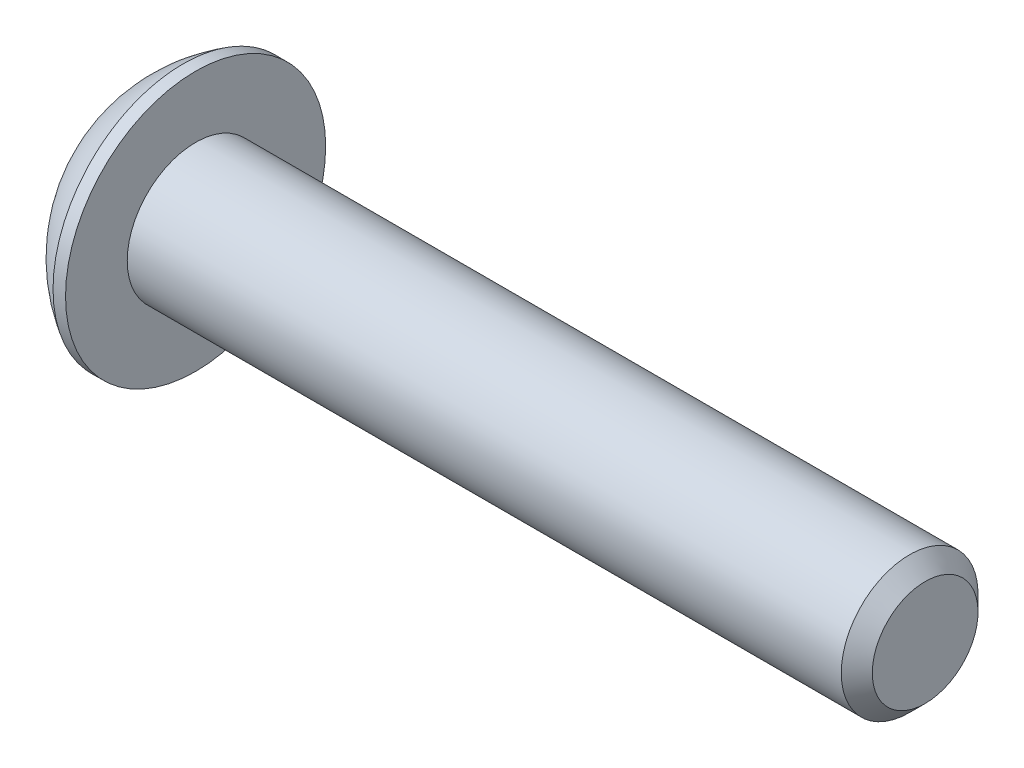
ISO-10303-21;
HEADER;
FILE_DESCRIPTION(('STEP AP214'),'2;1');
FILE_NAME('part.step','',(''),(''),'','','');
FILE_SCHEMA(('AUTOMOTIVE_DESIGN { 1 0 10303 214 1 1 1 1 }'));
ENDSEC;
DATA;
#1=APPLICATION_CONTEXT('core data for automotive mechanical design processes');
#2=APPLICATION_PROTOCOL_DEFINITION('international standard','automotive_design',2000,#1);
#3=PRODUCT_CONTEXT('',#1,'mechanical');
#4=PRODUCT('Part','Part','',(#3));
#5=PRODUCT_RELATED_PRODUCT_CATEGORY('part','',(#4));
#6=PRODUCT_DEFINITION_FORMATION('','',#4);
#7=PRODUCT_DEFINITION_CONTEXT('part definition',#1,'design');
#8=PRODUCT_DEFINITION('design','',#6,#7);
#9=PRODUCT_DEFINITION_SHAPE('','',#8);
#10=(LENGTH_UNIT() NAMED_UNIT(*) SI_UNIT(.MILLI.,.METRE.));
#11=(NAMED_UNIT(*) PLANE_ANGLE_UNIT() SI_UNIT($,.RADIAN.));
#12=(NAMED_UNIT(*) SI_UNIT($,.STERADIAN.) SOLID_ANGLE_UNIT());
#13=UNCERTAINTY_MEASURE_WITH_UNIT(LENGTH_MEASURE(1.E-05),#10,'distance_accuracy_value','');
#14=(GEOMETRIC_REPRESENTATION_CONTEXT(3) GLOBAL_UNCERTAINTY_ASSIGNED_CONTEXT((#13)) GLOBAL_UNIT_ASSIGNED_CONTEXT((#10,
#11,#12)) REPRESENTATION_CONTEXT('',''));
#15=CARTESIAN_POINT('',(0.,0.,0.));
#16=DIRECTION('',(0.,0.,1.));
#17=DIRECTION('',(1.,0.,0.));
#18=AXIS2_PLACEMENT_3D('',#15,#16,#17);
#19=CARTESIAN_POINT('',(1.32080000000034,0.,0.));
#20=DIRECTION('',(-1.,0.,0.));
#21=DIRECTION('',(0.,0.,1.));
#22=AXIS2_PLACEMENT_3D('',#19,#20,#21);
#23=CONICAL_SURFACE('',#22,1.1937999999998,1.04719755119608);
#24=CARTESIAN_POINT('',(2.01004075135902,0.,4.44089209850063E-13));
#25=VERTEX_POINT('',#24);
#26=VERTEX_LOOP('',#25);
#27=FACE_BOUND('',#26,.T.);
#28=CARTESIAN_POINT('',(1.32080000000009,0.,0.));
#29=DIRECTION('',(-1.,0.,0.));
#30=DIRECTION('',(0.,0.,1.));
#31=AXIS2_PLACEMENT_3D('',#28,#29,#30);
#32=CIRCLE('',#31,1.19380000000024);
#33=CARTESIAN_POINT('',(1.32080000000004,-1.03386112703797,0.59690000000006));
#34=VERTEX_POINT('',#33);
#35=CARTESIAN_POINT('',(1.32080000000004,0.,1.19380000000012));
#36=VERTEX_POINT('',#35);
#37=EDGE_CURVE('E19',#34,#36,#32,.T.);
#38=ORIENTED_EDGE('',*,*,#37,.T.);
#39=CARTESIAN_POINT('',(1.32080000000009,0.,0.));
#40=DIRECTION('',(-1.,0.,0.));
#41=DIRECTION('',(0.,0.,1.));
#42=AXIS2_PLACEMENT_3D('',#39,#40,#41);
#43=CIRCLE('',#42,1.19380000000024);
#44=CARTESIAN_POINT('',(1.32080000000004,1.03386112703797,0.596900000000061));
#45=VERTEX_POINT('',#44);
#46=EDGE_CURVE('E147',#36,#45,#43,.T.);
#47=ORIENTED_EDGE('',*,*,#46,.T.);
#48=CARTESIAN_POINT('',(1.32080000000009,0.,0.));
#49=DIRECTION('',(-1.,0.,0.));
#50=DIRECTION('',(0.,0.,1.));
#51=AXIS2_PLACEMENT_3D('',#48,#49,#50);
#52=CIRCLE('',#51,1.19380000000024);
#53=CARTESIAN_POINT('',(1.32080000000004,1.03386112703797,-0.596900000000061));
#54=VERTEX_POINT('',#53);
#55=EDGE_CURVE('E317',#45,#54,#52,.T.);
#56=ORIENTED_EDGE('',*,*,#55,.T.);
#57=CARTESIAN_POINT('',(1.32080000000009,0.,0.));
#58=DIRECTION('',(-1.,0.,0.));
#59=DIRECTION('',(0.,0.,1.));
#60=AXIS2_PLACEMENT_3D('',#57,#58,#59);
#61=CIRCLE('',#60,1.19380000000024);
#62=CARTESIAN_POINT('',(1.32080000000004,1.49457637585666E-12,-1.19380000000012));
#63=VERTEX_POINT('',#62);
#64=EDGE_CURVE('E318',#54,#63,#61,.T.);
#65=ORIENTED_EDGE('',*,*,#64,.T.);
#66=CARTESIAN_POINT('',(1.32080000000009,0.,0.));
#67=DIRECTION('',(-1.,0.,0.));
#68=DIRECTION('',(0.,0.,1.));
#69=AXIS2_PLACEMENT_3D('',#66,#67,#68);
#70=CIRCLE('',#69,1.19380000000024);
#71=CARTESIAN_POINT('',(1.32080000000004,-1.03386112703797,-0.59690000000006));
#72=VERTEX_POINT('',#71);
#73=EDGE_CURVE('E92',#63,#72,#70,.T.);
#74=ORIENTED_EDGE('',*,*,#73,.T.);
#75=CARTESIAN_POINT('',(1.32080000000009,0.,0.));
#76=DIRECTION('',(-1.,0.,0.));
#77=DIRECTION('',(0.,0.,1.));
#78=AXIS2_PLACEMENT_3D('',#75,#76,#77);
#79=CIRCLE('',#78,1.19380000000024);
#80=EDGE_CURVE('E88',#72,#34,#79,.T.);
#81=ORIENTED_EDGE('',*,*,#80,.T.);
#82=EDGE_LOOP('',(#38,#47,#56,#65,#74,#81));
#83=FACE_BOUND('',#82,.T.);
#84=ADVANCED_FACE('F16',(#27,#83),#23,.F.);
#85=CARTESIAN_POINT('',(1.3208,-2.06772225407572,-1.1938));
#86=DIRECTION('',(1.,0.,0.));
#87=DIRECTION('',(0.,0.,-1.));
#88=AXIS2_PLACEMENT_3D('',#85,#86,#87);
#89=PLANE('',#88);
#90=DIRECTION('',(0.,0.5,0.866025403784439));
#91=VECTOR('',#90,1.);
#92=CARTESIAN_POINT('',(1.3208,-1.37848150271715,0.));
#93=LINE('',#92,#91);
#94=CARTESIAN_POINT('',(1.3208,-0.689240751358574,1.1938));
#95=VERTEX_POINT('',#94);
#96=EDGE_CURVE('E100',#95,#34,#93,.F.);
#97=ORIENTED_EDGE('',*,*,#96,.F.);
#98=DIRECTION('',(0.,1.,0.));
#99=VECTOR('',#98,1.);
#100=CARTESIAN_POINT('',(1.3208,-0.689240751358574,1.1938));
#101=LINE('',#100,#99);
#102=EDGE_CURVE('E102',#36,#95,#101,.F.);
#103=ORIENTED_EDGE('',*,*,#102,.F.);
#104=ORIENTED_EDGE('',*,*,#37,.F.);
#105=EDGE_LOOP('',(#97,#103,#104));
#106=FACE_BOUND('',#105,.T.);
#107=ADVANCED_FACE('F98',(#106),#89,.F.);
#108=CARTESIAN_POINT('',(1.3208,-2.06772225407572,-1.1938));
#109=DIRECTION('',(1.,0.,0.));
#110=DIRECTION('',(0.,0.,-1.));
#111=AXIS2_PLACEMENT_3D('',#108,#109,#110);
#112=PLANE('',#111);
#113=DIRECTION('',(0.,-0.5,0.866025403784439));
#114=VECTOR('',#113,1.);
#115=CARTESIAN_POINT('',(1.3208,-0.689240751358574,-1.1938));
#116=LINE('',#115,#114);
#117=CARTESIAN_POINT('',(1.3208,-1.37848150271715,0.));
#118=VERTEX_POINT('',#117);
#119=EDGE_CURVE('E108',#118,#72,#116,.F.);
#120=ORIENTED_EDGE('',*,*,#119,.F.);
#121=DIRECTION('',(0.,0.5,0.866025403784439));
#122=VECTOR('',#121,1.);
#123=CARTESIAN_POINT('',(1.3208,-1.37848150271715,0.));
#124=LINE('',#123,#122);
#125=EDGE_CURVE('E105',#34,#118,#124,.F.);
#126=ORIENTED_EDGE('',*,*,#125,.F.);
#127=ORIENTED_EDGE('',*,*,#80,.F.);
#128=EDGE_LOOP('',(#120,#126,#127));
#129=FACE_BOUND('',#128,.T.);
#130=ADVANCED_FACE('F106',(#129),#112,.F.);
#131=CARTESIAN_POINT('',(1.3208,-2.06772225407572,-1.1938));
#132=DIRECTION('',(1.,0.,0.));
#133=DIRECTION('',(0.,0.,-1.));
#134=AXIS2_PLACEMENT_3D('',#131,#132,#133);
#135=PLANE('',#134);
#136=DIRECTION('',(0.,1.,0.));
#137=VECTOR('',#136,1.);
#138=CARTESIAN_POINT('',(1.3208,0.689240751358577,-1.1938));
#139=LINE('',#138,#137);
#140=CARTESIAN_POINT('',(1.3208,-0.689240751358574,-1.1938));
#141=VERTEX_POINT('',#140);
#142=EDGE_CURVE('E287',#141,#63,#139,.T.);
#143=ORIENTED_EDGE('',*,*,#142,.F.);
#144=DIRECTION('',(0.,-0.5,0.866025403784439));
#145=VECTOR('',#144,1.);
#146=CARTESIAN_POINT('',(1.3208,-0.689240751358574,-1.1938));
#147=LINE('',#146,#145);
#148=EDGE_CURVE('E299',#72,#141,#147,.F.);
#149=ORIENTED_EDGE('',*,*,#148,.F.);
#150=ORIENTED_EDGE('',*,*,#73,.F.);
#151=EDGE_LOOP('',(#143,#149,#150));
#152=FACE_BOUND('',#151,.T.);
#153=ADVANCED_FACE('F190',(#152),#135,.F.);
#154=CARTESIAN_POINT('',(1.3208,-2.06772225407572,-1.1938));
#155=DIRECTION('',(1.,0.,0.));
#156=DIRECTION('',(0.,0.,-1.));
#157=AXIS2_PLACEMENT_3D('',#154,#155,#156);
#158=PLANE('',#157);
#159=DIRECTION('',(0.,-0.5,-0.866025403784439));
#160=VECTOR('',#159,1.);
#161=CARTESIAN_POINT('',(1.3208,1.37848150271715,0.));
#162=LINE('',#161,#160);
#163=CARTESIAN_POINT('',(1.3208,0.689240751358577,-1.1938));
#164=VERTEX_POINT('',#163);
#165=EDGE_CURVE('E273',#164,#54,#162,.F.);
#166=ORIENTED_EDGE('',*,*,#165,.F.);
#167=DIRECTION('',(0.,1.,0.));
#168=VECTOR('',#167,1.);
#169=CARTESIAN_POINT('',(1.3208,0.689240751358577,-1.1938));
#170=LINE('',#169,#168);
#171=EDGE_CURVE('E284',#63,#164,#170,.T.);
#172=ORIENTED_EDGE('',*,*,#171,.F.);
#173=ORIENTED_EDGE('',*,*,#64,.F.);
#174=EDGE_LOOP('',(#166,#172,#173));
#175=FACE_BOUND('',#174,.T.);
#176=ADVANCED_FACE('F186',(#175),#158,.F.);
#177=CARTESIAN_POINT('',(1.3208,-2.06772225407572,-1.1938));
#178=DIRECTION('',(1.,0.,0.));
#179=DIRECTION('',(0.,0.,-1.));
#180=AXIS2_PLACEMENT_3D('',#177,#178,#179);
#181=PLANE('',#180);
#182=DIRECTION('',(0.,0.5,-0.866025403784439));
#183=VECTOR('',#182,1.);
#184=CARTESIAN_POINT('',(1.3208,0.689240751358576,1.1938));
#185=LINE('',#184,#183);
#186=CARTESIAN_POINT('',(1.3208,1.37848150271715,0.));
#187=VERTEX_POINT('',#186);
#188=EDGE_CURVE('E252',#187,#45,#185,.F.);
#189=ORIENTED_EDGE('',*,*,#188,.F.);
#190=DIRECTION('',(0.,-0.5,-0.866025403784439));
#191=VECTOR('',#190,1.);
#192=CARTESIAN_POINT('',(1.3208,1.37848150271715,0.));
#193=LINE('',#192,#191);
#194=EDGE_CURVE('E271',#54,#187,#193,.F.);
#195=ORIENTED_EDGE('',*,*,#194,.F.);
#196=ORIENTED_EDGE('',*,*,#55,.F.);
#197=EDGE_LOOP('',(#189,#195,#196));
#198=FACE_BOUND('',#197,.T.);
#199=ADVANCED_FACE('F182',(#198),#181,.F.);
#200=CARTESIAN_POINT('',(1.3208,-2.06772225407572,-1.1938));
#201=DIRECTION('',(1.,0.,0.));
#202=DIRECTION('',(0.,0.,-1.));
#203=AXIS2_PLACEMENT_3D('',#200,#201,#202);
#204=PLANE('',#203);
#205=DIRECTION('',(0.,1.,0.));
#206=VECTOR('',#205,1.);
#207=CARTESIAN_POINT('',(1.3208,-0.689240751358574,1.1938));
#208=LINE('',#207,#206);
#209=CARTESIAN_POINT('',(1.3208,0.689240751358576,1.1938));
#210=VERTEX_POINT('',#209);
#211=EDGE_CURVE('E117',#210,#36,#208,.F.);
#212=ORIENTED_EDGE('',*,*,#211,.F.);
#213=DIRECTION('',(0.,0.5,-0.866025403784439));
#214=VECTOR('',#213,1.);
#215=CARTESIAN_POINT('',(1.3208,0.689240751358576,1.1938));
#216=LINE('',#215,#214);
#217=EDGE_CURVE('E255',#45,#210,#216,.F.);
#218=ORIENTED_EDGE('',*,*,#217,.F.);
#219=ORIENTED_EDGE('',*,*,#46,.F.);
#220=EDGE_LOOP('',(#212,#218,#219));
#221=FACE_BOUND('',#220,.T.);
#222=ADVANCED_FACE('F178',(#221),#204,.F.);
#223=CARTESIAN_POINT('',(1.3208,-0.689240751358574,1.1938));
#224=DIRECTION('',(0.,0.,-1.));
#225=DIRECTION('',(0.,1.,0.));
#226=AXIS2_PLACEMENT_3D('',#223,#224,#225);
#227=PLANE('',#226);
#228=DIRECTION('',(0.,1.,0.));
#229=VECTOR('',#228,1.);
#230=CARTESIAN_POINT('',(0.,0.,1.1938));
#231=LINE('',#230,#229);
#232=CARTESIAN_POINT('',(0.,0.689240751358577,1.1938));
#233=VERTEX_POINT('',#232);
#234=CARTESIAN_POINT('',(0.,-0.689240751358574,1.1938));
#235=VERTEX_POINT('',#234);
#236=EDGE_CURVE('E249',#233,#235,#231,.F.);
#237=ORIENTED_EDGE('',*,*,#236,.F.);
#238=DIRECTION('',(1.,0.,0.));
#239=VECTOR('',#238,1.);
#240=CARTESIAN_POINT('',(1.3208,0.689240751358576,1.1938));
#241=LINE('',#240,#239);
#242=EDGE_CURVE('E261',#210,#233,#241,.F.);
#243=ORIENTED_EDGE('',*,*,#242,.F.);
#244=ORIENTED_EDGE('',*,*,#211,.T.);
#245=ORIENTED_EDGE('',*,*,#102,.T.);
#246=DIRECTION('',(1.,0.,0.));
#247=VECTOR('',#246,1.);
#248=CARTESIAN_POINT('',(1.3208,-0.689240751358574,1.1938));
#249=LINE('',#248,#247);
#250=EDGE_CURVE('E111',#235,#95,#249,.T.);
#251=ORIENTED_EDGE('',*,*,#250,.F.);
#252=EDGE_LOOP('',(#237,#243,#244,#245,#251));
#253=FACE_BOUND('',#252,.T.);
#254=ADVANCED_FACE('F175',(#253),#227,.T.);
#255=CARTESIAN_POINT('',(1.3208,-1.37848150271715,0.));
#256=DIRECTION('',(0.,0.866025403784439,-0.5));
#257=DIRECTION('',(0.,0.5,0.866025403784439));
#258=AXIS2_PLACEMENT_3D('',#255,#256,#257);
#259=PLANE('',#258);
#260=DIRECTION('',(0.,-0.5,-0.866025403784439));
#261=VECTOR('',#260,1.);
#262=CARTESIAN_POINT('',(0.,-0.689240751358574,1.1938));
#263=LINE('',#262,#261);
#264=CARTESIAN_POINT('',(0.,-1.37848150271715,0.));
#265=VERTEX_POINT('',#264);
#266=EDGE_CURVE('E246',#235,#265,#263,.T.);
#267=ORIENTED_EDGE('',*,*,#266,.F.);
#268=ORIENTED_EDGE('',*,*,#250,.T.);
#269=ORIENTED_EDGE('',*,*,#96,.T.);
#270=ORIENTED_EDGE('',*,*,#125,.T.);
#271=DIRECTION('',(1.,0.,0.));
#272=VECTOR('',#271,1.);
#273=CARTESIAN_POINT('',(1.3208,-1.37848150271715,0.));
#274=LINE('',#273,#272);
#275=EDGE_CURVE('E296',#265,#118,#274,.T.);
#276=ORIENTED_EDGE('',*,*,#275,.F.);
#277=EDGE_LOOP('',(#267,#268,#269,#270,#276));
#278=FACE_BOUND('',#277,.T.);
#279=ADVANCED_FACE('F115',(#278),#259,.T.);
#280=CARTESIAN_POINT('',(1.3208,-0.689240751358574,-1.1938));
#281=DIRECTION('',(0.,0.866025403784439,0.5));
#282=DIRECTION('',(0.,-0.5,0.866025403784439));
#283=AXIS2_PLACEMENT_3D('',#280,#281,#282);
#284=PLANE('',#283);
#285=DIRECTION('',(0.,0.5,-0.866025403784439));
#286=VECTOR('',#285,1.);
#287=CARTESIAN_POINT('',(0.,-1.37848150271715,0.));
#288=LINE('',#287,#286);
#289=CARTESIAN_POINT('',(0.,-0.689240751358574,-1.1938));
#290=VERTEX_POINT('',#289);
#291=EDGE_CURVE('E243',#265,#290,#288,.T.);
#292=ORIENTED_EDGE('',*,*,#291,.F.);
#293=ORIENTED_EDGE('',*,*,#275,.T.);
#294=ORIENTED_EDGE('',*,*,#119,.T.);
#295=ORIENTED_EDGE('',*,*,#148,.T.);
#296=DIRECTION('',(1.,0.,0.));
#297=VECTOR('',#296,1.);
#298=CARTESIAN_POINT('',(1.3208,-0.689240751358574,-1.1938));
#299=LINE('',#298,#297);
#300=EDGE_CURVE('E281',#290,#141,#299,.T.);
#301=ORIENTED_EDGE('',*,*,#300,.F.);
#302=EDGE_LOOP('',(#292,#293,#294,#295,#301));
#303=FACE_BOUND('',#302,.T.);
#304=ADVANCED_FACE('F168',(#303),#284,.T.);
#305=CARTESIAN_POINT('',(1.3208,0.689240751358577,-1.1938));
#306=DIRECTION('',(0.,0.,1.));
#307=DIRECTION('',(1.,0.,0.));
#308=AXIS2_PLACEMENT_3D('',#305,#306,#307);
#309=PLANE('',#308);
#310=DIRECTION('',(0.,1.,0.));
#311=VECTOR('',#310,1.);
#312=CARTESIAN_POINT('',(0.,0.,-1.1938));
#313=LINE('',#312,#311);
#314=CARTESIAN_POINT('',(0.,0.689240751358577,-1.1938));
#315=VERTEX_POINT('',#314);
#316=EDGE_CURVE('E240',#290,#315,#313,.T.);
#317=ORIENTED_EDGE('',*,*,#316,.F.);
#318=ORIENTED_EDGE('',*,*,#300,.T.);
#319=ORIENTED_EDGE('',*,*,#142,.T.);
#320=ORIENTED_EDGE('',*,*,#171,.T.);
#321=DIRECTION('',(1.,0.,0.));
#322=VECTOR('',#321,1.);
#323=CARTESIAN_POINT('',(1.3208,0.689240751358577,-1.1938));
#324=LINE('',#323,#322);
#325=EDGE_CURVE('E256',#315,#164,#324,.T.);
#326=ORIENTED_EDGE('',*,*,#325,.F.);
#327=EDGE_LOOP('',(#317,#318,#319,#320,#326));
#328=FACE_BOUND('',#327,.T.);
#329=ADVANCED_FACE('F165',(#328),#309,.T.);
#330=CARTESIAN_POINT('',(1.3208,1.37848150271715,0.));
#331=DIRECTION('',(0.,-0.866025403784439,0.5));
#332=DIRECTION('',(0.,-0.5,-0.866025403784439));
#333=AXIS2_PLACEMENT_3D('',#330,#331,#332);
#334=PLANE('',#333);
#335=DIRECTION('',(0.,0.5,0.866025403784439));
#336=VECTOR('',#335,1.);
#337=CARTESIAN_POINT('',(0.,0.689240751358577,-1.1938));
#338=LINE('',#337,#336);
#339=CARTESIAN_POINT('',(0.,1.37848150271715,0.));
#340=VERTEX_POINT('',#339);
#341=EDGE_CURVE('E237',#315,#340,#338,.T.);
#342=ORIENTED_EDGE('',*,*,#341,.F.);
#343=ORIENTED_EDGE('',*,*,#325,.T.);
#344=ORIENTED_EDGE('',*,*,#165,.T.);
#345=ORIENTED_EDGE('',*,*,#194,.T.);
#346=DIRECTION('',(1.,0.,0.));
#347=VECTOR('',#346,1.);
#348=CARTESIAN_POINT('',(1.3208,1.37848150271715,0.));
#349=LINE('',#348,#347);
#350=EDGE_CURVE('E34',#340,#187,#349,.T.);
#351=ORIENTED_EDGE('',*,*,#350,.F.);
#352=EDGE_LOOP('',(#342,#343,#344,#345,#351));
#353=FACE_BOUND('',#352,.T.);
#354=ADVANCED_FACE('F161',(#353),#334,.T.);
#355=CARTESIAN_POINT('',(1.3208,0.689240751358576,1.1938));
#356=DIRECTION('',(0.,-0.866025403784439,-0.5));
#357=DIRECTION('',(0.,0.5,-0.866025403784439));
#358=AXIS2_PLACEMENT_3D('',#355,#356,#357);
#359=PLANE('',#358);
#360=DIRECTION('',(0.,-0.5,0.866025403784439));
#361=VECTOR('',#360,1.);
#362=CARTESIAN_POINT('',(0.,1.37848150271715,0.));
#363=LINE('',#362,#361);
#364=EDGE_CURVE('E146',#340,#233,#363,.T.);
#365=ORIENTED_EDGE('',*,*,#364,.F.);
#366=ORIENTED_EDGE('',*,*,#350,.T.);
#367=ORIENTED_EDGE('',*,*,#188,.T.);
#368=ORIENTED_EDGE('',*,*,#217,.T.);
#369=ORIENTED_EDGE('',*,*,#242,.T.);
#370=EDGE_LOOP('',(#365,#366,#367,#368,#369));
#371=FACE_BOUND('',#370,.T.);
#372=ADVANCED_FACE('F157',(#371),#359,.T.);
#373=CARTESIAN_POINT('',(0.,0.,0.));
#374=DIRECTION('',(-1.,0.,0.));
#375=DIRECTION('',(0.,0.,1.));
#376=AXIS2_PLACEMENT_3D('',#373,#374,#375);
#377=PLANE('',#376);
#378=ORIENTED_EDGE('',*,*,#341,.T.);
#379=ORIENTED_EDGE('',*,*,#364,.T.);
#380=ORIENTED_EDGE('',*,*,#236,.T.);
#381=ORIENTED_EDGE('',*,*,#266,.T.);
#382=ORIENTED_EDGE('',*,*,#291,.T.);
#383=ORIENTED_EDGE('',*,*,#316,.T.);
#384=EDGE_LOOP('',(#378,#379,#380,#381,#382,#383));
#385=FACE_BOUND('',#384,.T.);
#386=CARTESIAN_POINT('',(0.,1.9812,0.));
#387=CARTESIAN_POINT('',(0.,1.9811996664299,0.0556258831179428));
#388=CARTESIAN_POINT('',(0.,1.97885520380442,0.111261989398606));
#389=CARTESIAN_POINT('',(0.,1.96949260169541,0.222149719830458));
#390=CARTESIAN_POINT('',(0.,1.96247308239605,0.277401225602895));
#391=CARTESIAN_POINT('',(0.,1.94379192841038,0.387209508139747));
#392=CARTESIAN_POINT('',(-1.85325793235264E-13,1.93212292489526,0.441765039546365));
#393=CARTESIAN_POINT('',(1.86344214223505E-13,1.90422331175315,0.549729449347493));
#394=CARTESIAN_POINT('',(6.94543371897454E-13,1.88798900035338,0.603137359208869));
#395=CARTESIAN_POINT('',(1.15501975216981E-12,1.83266214476501,0.760839131321828));
#396=CARTESIAN_POINT('',(0.,1.78690023648845,0.862876433575429));
#397=CARTESIAN_POINT('',(0.,1.67887358150667,1.05780719540872));
#398=CARTESIAN_POINT('',(9.54193214892627E-13,1.6166082074585,1.15070030720801));
#399=CARTESIAN_POINT('',(5.94805591894675E-13,1.51224157140982,1.28116890915697));
#400=CARTESIAN_POINT('',(1.63221293851378E-13,1.4755970394354,1.32320451127026));
#401=CARTESIAN_POINT('',(-1.62196980336157E-13,1.39893832619713,1.40400288695709));
#402=CARTESIAN_POINT('',(0.,1.35892742784698,1.44276877695455));
#403=CARTESIAN_POINT('',(1.14362537325405E-13,1.23416504602197,1.55382272417904));
#404=CARTESIAN_POINT('',(0.,1.14466125559859,1.62089527952111));
#405=CARTESIAN_POINT('',(0.,0.955712144178167,1.7390221808118));
#406=CARTESIAN_POINT('',(0.,0.856267198233564,1.79007713076007));
#407=CARTESIAN_POINT('',(0.,0.650206345910843,1.87477637530954));
#408=CARTESIAN_POINT('',(0.,0.543590516134855,1.90842085586267));
#409=CARTESIAN_POINT('',(0.,0.326226155292018,1.95733039300656));
#410=CARTESIAN_POINT('',(0.,0.21547760215793,1.97259535144288));
#411=CARTESIAN_POINT('',(0.,-0.00701040587544639,1.98431697865418));
#412=CARTESIAN_POINT('',(0.,-0.118749860774734,1.98077364742917));
#413=CARTESIAN_POINT('',(0.,-0.340050178355485,1.95497485623825));
#414=CARTESIAN_POINT('',(0.,-0.449611052668255,1.93271949620218));
#415=CARTESIAN_POINT('',(0.,-0.663431110729174,1.87014138774523));
#416=CARTESIAN_POINT('',(0.,-0.76769023783852,1.82981844635272));
#417=CARTESIAN_POINT('',(0.,-0.968005760719347,1.73219968377096));
#418=CARTESIAN_POINT('',(0.,-1.0640618469811,1.6749032225164));
#419=CARTESIAN_POINT('',(0.,-1.19980276751283,1.57757371205873));
#420=CARTESIAN_POINT('',(0.,-1.24366557129213,1.54322665019466));
#421=CARTESIAN_POINT('',(0.,-1.32838995706696,1.47093063174264));
#422=CARTESIAN_POINT('',(0.,-1.36924860178706,1.43297823102439));
#423=CARTESIAN_POINT('',(0.,-1.48674671849223,1.31419842051173));
#424=CARTESIAN_POINT('',(0.,-1.55842832343237,1.22836221289311));
#425=CARTESIAN_POINT('',(0.,-1.6863396856475,1.04586168272493));
#426=CARTESIAN_POINT('',(0.,-1.7425700302488,0.949197771949774));
#427=CARTESIAN_POINT('',(0.,-1.8141614250401,0.798182600298684));
#428=CARTESIAN_POINT('',(0.,-1.83591780585875,0.746776203847791));
#429=CARTESIAN_POINT('',(0.,-1.87500754181092,0.642341081688636));
#430=CARTESIAN_POINT('',(0.,-1.89234447645404,0.589313708122847));
#431=CARTESIAN_POINT('',(0.,-1.92246053433554,0.482076273028395));
#432=CARTESIAN_POINT('',(0.,-1.93524685475118,0.42786822425751));
#433=CARTESIAN_POINT('',(0.,-1.95620937250494,0.318578151844611));
#434=CARTESIAN_POINT('',(0.,-1.96438692958147,0.263496390912872));
#435=CARTESIAN_POINT('',(0.,-1.97388528284653,0.173607715038558));
#436=CARTESIAN_POINT('',(0.,-1.97662743364426,0.138944718024998));
#437=CARTESIAN_POINT('',(0.,-1.98028489645283,0.0695224782567002));
#438=CARTESIAN_POINT('',(0.,-1.98120020846367,0.0347632355019631));
#439=CARTESIAN_POINT('',(0.,-1.9811996664299,-0.0556258831179437));
#440=CARTESIAN_POINT('',(0.,-1.97885520380442,-0.111261989398607));
#441=CARTESIAN_POINT('',(0.,-1.96949260169541,-0.222149719830459));
#442=CARTESIAN_POINT('',(0.,-1.96247308239605,-0.277401225602897));
#443=CARTESIAN_POINT('',(0.,-1.94379192841039,-0.387209508139749));
#444=CARTESIAN_POINT('',(-1.85269749640691E-13,-1.93212292489526,-0.441765039546367));
#445=CARTESIAN_POINT('',(1.86288125054388E-13,-1.90422331175315,-0.549729449347495));
#446=CARTESIAN_POINT('',(6.94525090263764E-13,-1.88798900035338,-0.603137359208872));
#447=CARTESIAN_POINT('',(1.15505622829081E-12,-1.83266214476501,-0.760839131321831));
#448=CARTESIAN_POINT('',(0.,-1.78690023648845,-0.862876433575431));
#449=CARTESIAN_POINT('',(0.,-1.67887358150667,-1.05780719540872));
#450=CARTESIAN_POINT('',(9.54248812869379E-13,-1.6166082074585,-1.15070030720801));
#451=CARTESIAN_POINT('',(5.94777756479239E-13,-1.51224157140982,-1.28116890915698));
#452=CARTESIAN_POINT('',(1.63138949183833E-13,-1.47559703943539,-1.32320451127027));
#453=CARTESIAN_POINT('',(-1.62114715061273E-13,-1.39893832619713,-1.40400288695709));
#454=CARTESIAN_POINT('',(0.,-1.35892742784699,-1.44276877695455));
#455=CARTESIAN_POINT('',(1.13760489124207E-13,-1.23416504602197,-1.55382272417904));
#456=CARTESIAN_POINT('',(0.,-1.14466125559859,-1.62089527952111));
#457=CARTESIAN_POINT('',(0.,-0.95571214417816,-1.73902218081179));
#458=CARTESIAN_POINT('',(0.,-0.856267198233559,-1.79007713076007));
#459=CARTESIAN_POINT('',(0.,-0.650206345910841,-1.87477637530954));
#460=CARTESIAN_POINT('',(0.,-0.543590516134854,-1.90842085586267));
#461=CARTESIAN_POINT('',(0.,-0.326226155292018,-1.95733039300657));
#462=CARTESIAN_POINT('',(0.,-0.215477602157929,-1.97259535144288));
#463=CARTESIAN_POINT('',(0.,0.0070104058754487,-1.98431697865418));
#464=CARTESIAN_POINT('',(0.,0.118749860774737,-1.98077364742916));
#465=CARTESIAN_POINT('',(0.,0.340050178355489,-1.95497485623824));
#466=CARTESIAN_POINT('',(0.,0.44961105266826,-1.93271949620218));
#467=CARTESIAN_POINT('',(0.,0.663431110729178,-1.87014138774524));
#468=CARTESIAN_POINT('',(0.,0.767690237838524,-1.82981844635272));
#469=CARTESIAN_POINT('',(0.,0.968005760719348,-1.73219968377096));
#470=CARTESIAN_POINT('',(0.,1.0640618469811,-1.67490322251639));
#471=CARTESIAN_POINT('',(0.,1.19980276751283,-1.57757371205873));
#472=CARTESIAN_POINT('',(0.,1.24366557129214,-1.54322665019465));
#473=CARTESIAN_POINT('',(0.,1.32838995706696,-1.47093063174263));
#474=CARTESIAN_POINT('',(0.,1.36924860178706,-1.43297823102439));
#475=CARTESIAN_POINT('',(0.,1.48674671849223,-1.31419842051172));
#476=CARTESIAN_POINT('',(0.,1.55842832343237,-1.22836221289311));
#477=CARTESIAN_POINT('',(0.,1.6863396856475,-1.04586168272492));
#478=CARTESIAN_POINT('',(0.,1.7425700302488,-0.949197771949768));
#479=CARTESIAN_POINT('',(0.,1.8141614250401,-0.798182600298677));
#480=CARTESIAN_POINT('',(0.,1.83591780585875,-0.746776203847785));
#481=CARTESIAN_POINT('',(0.,1.87500754181092,-0.64234108168863));
#482=CARTESIAN_POINT('',(0.,1.89234447645404,-0.589313708122841));
#483=CARTESIAN_POINT('',(0.,1.92246053433555,-0.482076273028389));
#484=CARTESIAN_POINT('',(0.,1.93524685475118,-0.427868224257505));
#485=CARTESIAN_POINT('',(0.,1.95620937250494,-0.318578151844605));
#486=CARTESIAN_POINT('',(0.,1.96438692958147,-0.263496390912866));
#487=CARTESIAN_POINT('',(0.,1.97388528284653,-0.173607715038553));
#488=CARTESIAN_POINT('',(0.,1.97662743364426,-0.138944718024994));
#489=CARTESIAN_POINT('',(0.,1.98028489645283,-0.0695224782566989));
#490=CARTESIAN_POINT('',(0.,1.98120020846367,-0.034763235501963));
#491=CARTESIAN_POINT('',(0.,1.9812,0.));
#492=B_SPLINE_CURVE_WITH_KNOTS('',3,(#386,#387,#388,#389,#390,#391,#392,#393,#394,#395,#396,
#397,#398,#399,#400,#401,#402,#403,#404,#405,#406,#407,#408,#409,#410,#411,#412,#413,#414,#415,
#416,#417,#418,#419,#420,#421,#422,#423,#424,#425,#426,#427,#428,#429,#430,#431,#432,#433,#434,
#435,#436,#437,#438,#439,#440,#441,#442,#443,#444,#445,#446,#447,#448,#449,#450,#451,#452,#453,
#454,#455,#456,#457,#458,#459,#460,#461,#462,#463,#464,#465,#466,#467,#468,#469,#470,#471,#472,
#473,#474,#475,#476,#477,#478,#479,#480,#481,#482,#483,#484,#485,#486,#487,#488,#489,#490,#491),
.UNSPECIFIED.,.T.,.F.,(4,2,2,2,2,2,2,2,2,2,2,2,2,2,2,2,2,2,2,2,2,2,2,2,2,2,2,2,2,2,2,2,2,2,2,2,
2,2,2,2,2,2,2,2,2,2,2,2,2,2,2,2,4),(0.,0.166845646007828,0.333740557374255,0.500901034367693,
0.668197445942386,1.00199278686282,1.33580081809885,1.50292354032982,1.6698851310853,
2.00370118900129,2.33750465770544,2.67130456115909,3.005106247238,3.33890793331696,
3.67270783677065,4.00651130547476,4.34032736339026,4.50728895414554,4.67441167637632,
5.00821970761259,5.34201504853332,5.50931146010827,5.67647193710191,5.84336684846844,
6.0102124944764,6.11448220058334,6.21875190669029,6.38559755269812,6.55249246406454,
6.71965294105798,6.88694935263268,7.22074469355311,7.55455272478915,7.72167544702011,
7.88863703777559,8.22245309569158,8.55625656439573,8.89005646784938,9.2238581539283,
9.55765984000725,9.89145974346094,10.2252632121651,10.5590792700806,10.7260408608358,
10.8931635830666,11.2269716143029,11.5607669552236,11.7280633667986,11.8952238437922,
12.0621187551587,12.2289644011667,12.3332341072736,12.4375038133806),.UNSPECIFIED.);
#493=CARTESIAN_POINT('',(0.,1.9812,0.));
#494=VERTEX_POINT('',#493);
#495=EDGE_CURVE('E139',#494,#494,#492,.T.);
#496=ORIENTED_EDGE('',*,*,#495,.F.);
#497=EDGE_LOOP('',(#496));
#498=FACE_BOUND('',#497,.T.);
#499=ADVANCED_FACE('F153',(#385,#498),#377,.T.);
#500=CARTESIAN_POINT('',(4.13385,0.,0.));
#501=DIRECTION('',(0.,1.,0.));
#502=DIRECTION('',(1.,0.,0.));
#503=AXIS2_PLACEMENT_3D('',#500,#501,#502);
#504=SPHERICAL_SURFACE('',#503,4.58408870578439);
#505=CARTESIAN_POINT('',(1.8288,0.,0.));
#506=DIRECTION('',(-1.,0.,0.));
#507=DIRECTION('',(0.,0.,1.));
#508=AXIS2_PLACEMENT_3D('',#505,#506,#507);
#509=CIRCLE('',#508,3.9624);
#510=CARTESIAN_POINT('',(1.8288,0.,3.9624));
#511=VERTEX_POINT('',#510);
#512=EDGE_CURVE('E136',#511,#511,#509,.F.);
#513=ORIENTED_EDGE('',*,*,#512,.F.);
#514=EDGE_LOOP('',(#513));
#515=FACE_BOUND('',#514,.T.);
#516=ORIENTED_EDGE('',*,*,#495,.T.);
#517=EDGE_LOOP('',(#516));
#518=FACE_BOUND('',#517,.T.);
#519=ADVANCED_FACE('F149',(#515,#518),#504,.T.);
#520=CARTESIAN_POINT('',(24.4348,0.,0.));
#521=DIRECTION('',(-1.,0.,0.));
#522=DIRECTION('',(0.,0.,1.));
#523=AXIS2_PLACEMENT_3D('',#520,#521,#522);
#524=PLANE('',#523);
#525=CARTESIAN_POINT('',(24.4347999999945,0.,0.));
#526=DIRECTION('',(-1.,0.,0.));
#527=DIRECTION('',(0.,-1.,0.));
#528=AXIS2_PLACEMENT_3D('',#525,#526,#527);
#529=CIRCLE('',#528,1.61035999991554);
#530=CARTESIAN_POINT('',(24.4347999999945,-1.61035999991554,0.));
#531=VERTEX_POINT('',#530);
#532=EDGE_CURVE('E133',#531,#531,#529,.T.);
#533=ORIENTED_EDGE('',*,*,#532,.F.);
#534=EDGE_LOOP('',(#533));
#535=FACE_BOUND('',#534,.T.);
#536=ADVANCED_FACE('F221',(#535),#524,.F.);
#537=CARTESIAN_POINT('',(0.,0.,0.));
#538=DIRECTION('',(-1.,0.,0.));
#539=DIRECTION('',(0.,0.,1.));
#540=AXIS2_PLACEMENT_3D('',#537,#538,#539);
#541=CYLINDRICAL_SURFACE('',#540,3.9624);
#542=ORIENTED_EDGE('',*,*,#512,.T.);
#543=EDGE_LOOP('',(#542));
#544=FACE_BOUND('',#543,.T.);
#545=CARTESIAN_POINT('',(2.2098,0.,0.));
#546=DIRECTION('',(-1.,0.,0.));
#547=DIRECTION('',(0.,0.,1.));
#548=AXIS2_PLACEMENT_3D('',#545,#546,#547);
#549=CIRCLE('',#548,3.9624);
#550=CARTESIAN_POINT('',(2.2098,0.,3.9624));
#551=VERTEX_POINT('',#550);
#552=EDGE_CURVE('E130',#551,#551,#549,.T.);
#553=ORIENTED_EDGE('',*,*,#552,.T.);
#554=EDGE_LOOP('',(#553));
#555=FACE_BOUND('',#554,.T.);
#556=ADVANCED_FACE('F218',(#544,#555),#541,.T.);
#557=CARTESIAN_POINT('',(23.9623599998708,0.,0.));
#558=DIRECTION('',(-1.,0.,0.));
#559=DIRECTION('',(0.,-1.,0.));
#560=AXIS2_PLACEMENT_3D('',#557,#558,#559);
#561=CONICAL_SURFACE('',#560,2.08280000003924,0.785398163397448);
#562=ORIENTED_EDGE('',*,*,#532,.T.);
#563=EDGE_LOOP('',(#562));
#564=FACE_BOUND('',#563,.T.);
#565=CARTESIAN_POINT('',(23.96236,0.,0.));
#566=DIRECTION('',(-1.,0.,0.));
#567=DIRECTION('',(0.,0.,1.));
#568=AXIS2_PLACEMENT_3D('',#565,#566,#567);
#569=CIRCLE('',#568,2.0828);
#570=CARTESIAN_POINT('',(23.96236,0.,2.0828));
#571=VERTEX_POINT('',#570);
#572=EDGE_CURVE('E25',#571,#571,#569,.T.);
#573=ORIENTED_EDGE('',*,*,#572,.F.);
#574=EDGE_LOOP('',(#573));
#575=FACE_BOUND('',#574,.T.);
#576=ADVANCED_FACE('F210',(#564,#575),#561,.T.);
#577=CARTESIAN_POINT('',(2.2098,2.0828,0.));
#578=DIRECTION('',(-1.,0.,0.));
#579=DIRECTION('',(0.,0.,1.));
#580=AXIS2_PLACEMENT_3D('',#577,#578,#579);
#581=PLANE('',#580);
#582=CARTESIAN_POINT('',(2.2098,0.,0.));
#583=DIRECTION('',(-1.,0.,0.));
#584=DIRECTION('',(0.,0.,1.));
#585=AXIS2_PLACEMENT_3D('',#582,#583,#584);
#586=CIRCLE('',#585,2.0828);
#587=CARTESIAN_POINT('',(2.2098,0.,2.0828));
#588=VERTEX_POINT('',#587);
#589=EDGE_CURVE('E10',#588,#588,#586,.F.);
#590=ORIENTED_EDGE('',*,*,#589,.F.);
#591=EDGE_LOOP('',(#590));
#592=FACE_BOUND('',#591,.T.);
#593=ORIENTED_EDGE('',*,*,#552,.F.);
#594=EDGE_LOOP('',(#593));
#595=FACE_BOUND('',#594,.T.);
#596=ADVANCED_FACE('F204',(#592,#595),#581,.F.);
#597=CARTESIAN_POINT('',(0.,0.,0.));
#598=DIRECTION('',(-1.,0.,0.));
#599=DIRECTION('',(0.,0.,1.));
#600=AXIS2_PLACEMENT_3D('',#597,#598,#599);
#601=CYLINDRICAL_SURFACE('',#600,2.0828);
#602=ORIENTED_EDGE('',*,*,#572,.T.);
#603=EDGE_LOOP('',(#602));
#604=FACE_BOUND('',#603,.T.);
#605=ORIENTED_EDGE('',*,*,#589,.T.);
#606=EDGE_LOOP('',(#605));
#607=FACE_BOUND('',#606,.T.);
#608=ADVANCED_FACE('F202',(#604,#607),#601,.T.);
#609=CLOSED_SHELL('',(#84,#107,#130,#153,#176,#199,#222,#254,#279,#304,#329,#354,#372,#499,#519,
#536,#556,#576,#596,#608));
#610=MANIFOLD_SOLID_BREP('B1',#609);
#611=ADVANCED_BREP_SHAPE_REPRESENTATION('',(#18,#610),#14);
#612=SHAPE_DEFINITION_REPRESENTATION(#9,#611);
ENDSEC;
END-ISO-10303-21;
